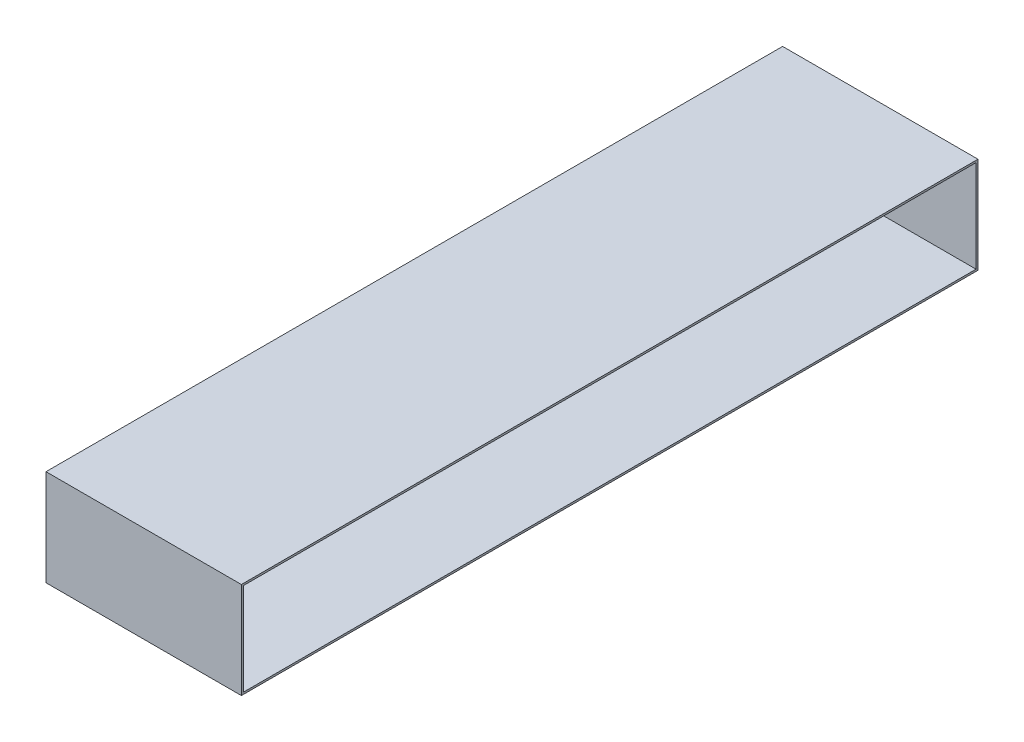
ISO-10303-21;
HEADER;
FILE_DESCRIPTION(('STEP AP214'),'2;1');
FILE_NAME('part.step','',(''),(''),'','','');
FILE_SCHEMA(('AUTOMOTIVE_DESIGN { 1 0 10303 214 1 1 1 1 }'));
ENDSEC;
DATA;
#1=APPLICATION_CONTEXT('core data for automotive mechanical design processes');
#2=APPLICATION_PROTOCOL_DEFINITION('international standard','automotive_design',2000,#1);
#3=PRODUCT_CONTEXT('',#1,'mechanical');
#4=PRODUCT('Part','Part','',(#3));
#5=PRODUCT_RELATED_PRODUCT_CATEGORY('part','',(#4));
#6=PRODUCT_DEFINITION_FORMATION('','',#4);
#7=PRODUCT_DEFINITION_CONTEXT('part definition',#1,'design');
#8=PRODUCT_DEFINITION('design','',#6,#7);
#9=PRODUCT_DEFINITION_SHAPE('','',#8);
#10=(LENGTH_UNIT() NAMED_UNIT(*) SI_UNIT(.MILLI.,.METRE.));
#11=(NAMED_UNIT(*) PLANE_ANGLE_UNIT() SI_UNIT($,.RADIAN.));
#12=(NAMED_UNIT(*) SI_UNIT($,.STERADIAN.) SOLID_ANGLE_UNIT());
#13=UNCERTAINTY_MEASURE_WITH_UNIT(LENGTH_MEASURE(1.E-05),#10,'distance_accuracy_value','');
#14=(GEOMETRIC_REPRESENTATION_CONTEXT(3) GLOBAL_UNCERTAINTY_ASSIGNED_CONTEXT((#13)) GLOBAL_UNIT_ASSIGNED_CONTEXT((#10,
#11,#12)) REPRESENTATION_CONTEXT('',''));
#15=CARTESIAN_POINT('',(0.,0.,0.));
#16=DIRECTION('',(0.,0.,1.));
#17=DIRECTION('',(1.,0.,0.));
#18=AXIS2_PLACEMENT_3D('',#15,#16,#17);
#19=CARTESIAN_POINT('',(12.7,6.254,47.879));
#20=DIRECTION('',(0.,-1.,0.));
#21=DIRECTION('',(0.,0.,-1.));
#22=AXIS2_PLACEMENT_3D('',#19,#20,#21);
#23=PLANE('',#22);
#24=DIRECTION('',(-1.,0.,0.));
#25=VECTOR('',#24,1.);
#26=CARTESIAN_POINT('',(12.7,6.254,47.879));
#27=LINE('',#26,#25);
#28=CARTESIAN_POINT('',(-12.7,6.254,47.879));
#29=VERTEX_POINT('',#28);
#30=CARTESIAN_POINT('',(12.7,6.254,47.879));
#31=VERTEX_POINT('',#30);
#32=EDGE_CURVE('E111',#29,#31,#27,.F.);
#33=ORIENTED_EDGE('',*,*,#32,.T.);
#34=DIRECTION('',(0.,0.,1.));
#35=VECTOR('',#34,1.);
#36=CARTESIAN_POINT('',(12.7,6.254,0.));
#37=LINE('',#36,#35);
#38=CARTESIAN_POINT('',(12.7,6.254,-47.879));
#39=VERTEX_POINT('',#38);
#40=EDGE_CURVE('E106',#31,#39,#37,.F.);
#41=ORIENTED_EDGE('',*,*,#40,.T.);
#42=DIRECTION('',(1.,0.,0.));
#43=VECTOR('',#42,1.);
#44=CARTESIAN_POINT('',(12.7,6.254,-47.879));
#45=LINE('',#44,#43);
#46=CARTESIAN_POINT('',(-12.7,6.254,-47.879));
#47=VERTEX_POINT('',#46);
#48=EDGE_CURVE('E128',#39,#47,#45,.F.);
#49=ORIENTED_EDGE('',*,*,#48,.T.);
#50=DIRECTION('',(0.,0.,1.));
#51=VECTOR('',#50,1.);
#52=CARTESIAN_POINT('',(-12.7,6.254,0.));
#53=LINE('',#52,#51);
#54=EDGE_CURVE('E134',#29,#47,#53,.F.);
#55=ORIENTED_EDGE('',*,*,#54,.F.);
#56=EDGE_LOOP('',(#33,#41,#49,#55));
#57=FACE_BOUND('',#56,.T.);
#58=ADVANCED_FACE('F16',(#57),#23,.F.);
#59=CARTESIAN_POINT('',(12.7,-6.,47.625));
#60=DIRECTION('',(0.,1.,0.));
#61=DIRECTION('',(0.,0.,1.));
#62=AXIS2_PLACEMENT_3D('',#59,#60,#61);
#63=PLANE('',#62);
#64=DIRECTION('',(0.,0.,1.));
#65=VECTOR('',#64,1.);
#66=CARTESIAN_POINT('',(12.7,-6.,0.));
#67=LINE('',#66,#65);
#68=CARTESIAN_POINT('',(12.7,-6.,47.625));
#69=VERTEX_POINT('',#68);
#70=CARTESIAN_POINT('',(12.7,-6.,-47.625));
#71=VERTEX_POINT('',#70);
#72=EDGE_CURVE('E99',#69,#71,#67,.F.);
#73=ORIENTED_EDGE('',*,*,#72,.T.);
#74=DIRECTION('',(1.,0.,0.));
#75=VECTOR('',#74,1.);
#76=CARTESIAN_POINT('',(12.7,-6.,-47.625));
#77=LINE('',#76,#75);
#78=CARTESIAN_POINT('',(-12.7,-6.,-47.625));
#79=VERTEX_POINT('',#78);
#80=EDGE_CURVE('E19',#79,#71,#77,.T.);
#81=ORIENTED_EDGE('',*,*,#80,.F.);
#82=DIRECTION('',(0.,0.,1.));
#83=VECTOR('',#82,1.);
#84=CARTESIAN_POINT('',(-12.7,-6.,0.));
#85=LINE('',#84,#83);
#86=CARTESIAN_POINT('',(-12.7,-6.,47.625));
#87=VERTEX_POINT('',#86);
#88=EDGE_CURVE('E137',#87,#79,#85,.F.);
#89=ORIENTED_EDGE('',*,*,#88,.F.);
#90=DIRECTION('',(-1.,0.,0.));
#91=VECTOR('',#90,1.);
#92=CARTESIAN_POINT('',(12.7,-6.,47.625));
#93=LINE('',#92,#91);
#94=EDGE_CURVE('E87',#69,#87,#93,.T.);
#95=ORIENTED_EDGE('',*,*,#94,.F.);
#96=EDGE_LOOP('',(#73,#81,#89,#95));
#97=FACE_BOUND('',#96,.T.);
#98=ADVANCED_FACE('F124',(#97),#63,.T.);
#99=CARTESIAN_POINT('',(12.7,-6.,-47.625));
#100=DIRECTION('',(0.,0.,1.));
#101=DIRECTION('',(1.,0.,0.));
#102=AXIS2_PLACEMENT_3D('',#99,#100,#101);
#103=PLANE('',#102);
#104=DIRECTION('',(0.,1.,0.));
#105=VECTOR('',#104,1.);
#106=CARTESIAN_POINT('',(12.7,0.,-47.625));
#107=LINE('',#106,#105);
#108=CARTESIAN_POINT('',(12.7,6.,-47.625));
#109=VERTEX_POINT('',#108);
#110=EDGE_CURVE('E118',#71,#109,#107,.T.);
#111=ORIENTED_EDGE('',*,*,#110,.T.);
#112=DIRECTION('',(1.,0.,0.));
#113=VECTOR('',#112,1.);
#114=CARTESIAN_POINT('',(12.7,6.,-47.625));
#115=LINE('',#114,#113);
#116=CARTESIAN_POINT('',(-12.7,6.,-47.625));
#117=VERTEX_POINT('',#116);
#118=EDGE_CURVE('E88',#117,#109,#115,.T.);
#119=ORIENTED_EDGE('',*,*,#118,.F.);
#120=DIRECTION('',(0.,1.,0.));
#121=VECTOR('',#120,1.);
#122=CARTESIAN_POINT('',(-12.7,0.,-47.625));
#123=LINE('',#122,#121);
#124=EDGE_CURVE('E119',#79,#117,#123,.T.);
#125=ORIENTED_EDGE('',*,*,#124,.F.);
#126=ORIENTED_EDGE('',*,*,#80,.T.);
#127=EDGE_LOOP('',(#111,#119,#125,#126));
#128=FACE_BOUND('',#127,.T.);
#129=ADVANCED_FACE('F117',(#128),#103,.T.);
#130=CARTESIAN_POINT('',(12.7,6.,47.625));
#131=DIRECTION('',(0.,-1.,0.));
#132=DIRECTION('',(0.,0.,-1.));
#133=AXIS2_PLACEMENT_3D('',#130,#131,#132);
#134=PLANE('',#133);
#135=DIRECTION('',(0.,0.,1.));
#136=VECTOR('',#135,1.);
#137=CARTESIAN_POINT('',(12.7,6.,0.));
#138=LINE('',#137,#136);
#139=CARTESIAN_POINT('',(12.7,6.,47.625));
#140=VERTEX_POINT('',#139);
#141=EDGE_CURVE('E96',#109,#140,#138,.T.);
#142=ORIENTED_EDGE('',*,*,#141,.T.);
#143=DIRECTION('',(-1.,0.,0.));
#144=VECTOR('',#143,1.);
#145=CARTESIAN_POINT('',(12.7,6.,47.625));
#146=LINE('',#145,#144);
#147=CARTESIAN_POINT('',(-12.7,6.,47.625));
#148=VERTEX_POINT('',#147);
#149=EDGE_CURVE('E78',#148,#140,#146,.F.);
#150=ORIENTED_EDGE('',*,*,#149,.F.);
#151=DIRECTION('',(0.,0.,1.));
#152=VECTOR('',#151,1.);
#153=CARTESIAN_POINT('',(-12.7,6.,0.));
#154=LINE('',#153,#152);
#155=EDGE_CURVE('E140',#117,#148,#154,.T.);
#156=ORIENTED_EDGE('',*,*,#155,.F.);
#157=ORIENTED_EDGE('',*,*,#118,.T.);
#158=EDGE_LOOP('',(#142,#150,#156,#157));
#159=FACE_BOUND('',#158,.T.);
#160=ADVANCED_FACE('F101',(#159),#134,.T.);
#161=CARTESIAN_POINT('',(12.7,-6.,47.625));
#162=DIRECTION('',(0.,0.,-1.));
#163=DIRECTION('',(-1.,0.,0.));
#164=AXIS2_PLACEMENT_3D('',#161,#162,#163);
#165=PLANE('',#164);
#166=DIRECTION('',(0.,1.,0.));
#167=VECTOR('',#166,1.);
#168=CARTESIAN_POINT('',(12.7,0.,47.625));
#169=LINE('',#168,#167);
#170=EDGE_CURVE('E81',#140,#69,#169,.F.);
#171=ORIENTED_EDGE('',*,*,#170,.T.);
#172=ORIENTED_EDGE('',*,*,#94,.T.);
#173=DIRECTION('',(0.,1.,0.));
#174=VECTOR('',#173,1.);
#175=CARTESIAN_POINT('',(-12.7,0.,47.625));
#176=LINE('',#175,#174);
#177=EDGE_CURVE('E83',#148,#87,#176,.F.);
#178=ORIENTED_EDGE('',*,*,#177,.F.);
#179=ORIENTED_EDGE('',*,*,#149,.T.);
#180=EDGE_LOOP('',(#171,#172,#178,#179));
#181=FACE_BOUND('',#180,.T.);
#182=ADVANCED_FACE('F80',(#181),#165,.T.);
#183=CARTESIAN_POINT('',(12.7,-6.254,47.879));
#184=DIRECTION('',(0.,0.,-1.));
#185=DIRECTION('',(-1.,0.,0.));
#186=AXIS2_PLACEMENT_3D('',#183,#184,#185);
#187=PLANE('',#186);
#188=DIRECTION('',(1.,0.,0.));
#189=VECTOR('',#188,1.);
#190=CARTESIAN_POINT('',(12.7,-6.254,47.879));
#191=LINE('',#190,#189);
#192=CARTESIAN_POINT('',(-12.7,-6.254,47.879));
#193=VERTEX_POINT('',#192);
#194=CARTESIAN_POINT('',(12.7,-6.254,47.879));
#195=VERTEX_POINT('',#194);
#196=EDGE_CURVE('E143',#193,#195,#191,.T.);
#197=ORIENTED_EDGE('',*,*,#196,.T.);
#198=DIRECTION('',(0.,1.,0.));
#199=VECTOR('',#198,1.);
#200=CARTESIAN_POINT('',(12.7,0.,47.879));
#201=LINE('',#200,#199);
#202=EDGE_CURVE('E103',#195,#31,#201,.T.);
#203=ORIENTED_EDGE('',*,*,#202,.T.);
#204=ORIENTED_EDGE('',*,*,#32,.F.);
#205=DIRECTION('',(0.,1.,0.));
#206=VECTOR('',#205,1.);
#207=CARTESIAN_POINT('',(-12.7,0.,47.879));
#208=LINE('',#207,#206);
#209=EDGE_CURVE('E131',#193,#29,#208,.T.);
#210=ORIENTED_EDGE('',*,*,#209,.F.);
#211=EDGE_LOOP('',(#197,#203,#204,#210));
#212=FACE_BOUND('',#211,.T.);
#213=ADVANCED_FACE('F159',(#212),#187,.F.);
#214=CARTESIAN_POINT('',(12.7,0.,0.));
#215=DIRECTION('',(-1.,0.,0.));
#216=DIRECTION('',(0.,0.,1.));
#217=AXIS2_PLACEMENT_3D('',#214,#215,#216);
#218=PLANE('',#217);
#219=ORIENTED_EDGE('',*,*,#72,.F.);
#220=ORIENTED_EDGE('',*,*,#170,.F.);
#221=ORIENTED_EDGE('',*,*,#141,.F.);
#222=ORIENTED_EDGE('',*,*,#110,.F.);
#223=EDGE_LOOP('',(#219,#220,#221,#222));
#224=FACE_BOUND('',#223,.T.);
#225=DIRECTION('',(0.,0.,1.));
#226=VECTOR('',#225,1.);
#227=CARTESIAN_POINT('',(12.7,-6.254,47.879));
#228=LINE('',#227,#226);
#229=CARTESIAN_POINT('',(12.7,-6.254,-47.879));
#230=VERTEX_POINT('',#229);
#231=EDGE_CURVE('E146',#195,#230,#228,.F.);
#232=ORIENTED_EDGE('',*,*,#231,.T.);
#233=DIRECTION('',(0.,-1.,0.));
#234=VECTOR('',#233,1.);
#235=CARTESIAN_POINT('',(12.7,-6.254,-47.879));
#236=LINE('',#235,#234);
#237=EDGE_CURVE('E122',#230,#39,#236,.F.);
#238=ORIENTED_EDGE('',*,*,#237,.T.);
#239=ORIENTED_EDGE('',*,*,#40,.F.);
#240=ORIENTED_EDGE('',*,*,#202,.F.);
#241=EDGE_LOOP('',(#232,#238,#239,#240));
#242=FACE_BOUND('',#241,.T.);
#243=ADVANCED_FACE('F93',(#224,#242),#218,.F.);
#244=CARTESIAN_POINT('',(12.7,-6.254,-47.879));
#245=DIRECTION('',(0.,0.,1.));
#246=DIRECTION('',(0.,-1.,0.));
#247=AXIS2_PLACEMENT_3D('',#244,#245,#246);
#248=PLANE('',#247);
#249=ORIENTED_EDGE('',*,*,#48,.F.);
#250=ORIENTED_EDGE('',*,*,#237,.F.);
#251=DIRECTION('',(1.,0.,0.));
#252=VECTOR('',#251,1.);
#253=CARTESIAN_POINT('',(12.7,-6.254,-47.879));
#254=LINE('',#253,#252);
#255=CARTESIAN_POINT('',(-12.7,-6.254,-47.879));
#256=VERTEX_POINT('',#255);
#257=EDGE_CURVE('E25',#230,#256,#254,.F.);
#258=ORIENTED_EDGE('',*,*,#257,.T.);
#259=DIRECTION('',(0.,1.,0.));
#260=VECTOR('',#259,1.);
#261=CARTESIAN_POINT('',(-12.7,0.,-47.879));
#262=LINE('',#261,#260);
#263=EDGE_CURVE('E33',#47,#256,#262,.F.);
#264=ORIENTED_EDGE('',*,*,#263,.F.);
#265=EDGE_LOOP('',(#249,#250,#258,#264));
#266=FACE_BOUND('',#265,.T.);
#267=ADVANCED_FACE('F153',(#266),#248,.F.);
#268=CARTESIAN_POINT('',(-12.7,0.,0.));
#269=DIRECTION('',(-1.,0.,0.));
#270=DIRECTION('',(0.,0.,1.));
#271=AXIS2_PLACEMENT_3D('',#268,#269,#270);
#272=PLANE('',#271);
#273=ORIENTED_EDGE('',*,*,#155,.T.);
#274=ORIENTED_EDGE('',*,*,#177,.T.);
#275=ORIENTED_EDGE('',*,*,#88,.T.);
#276=ORIENTED_EDGE('',*,*,#124,.T.);
#277=EDGE_LOOP('',(#273,#274,#275,#276));
#278=FACE_BOUND('',#277,.T.);
#279=ORIENTED_EDGE('',*,*,#263,.T.);
#280=DIRECTION('',(0.,0.,1.));
#281=VECTOR('',#280,1.);
#282=CARTESIAN_POINT('',(-12.7,-6.254,47.879));
#283=LINE('',#282,#281);
#284=EDGE_CURVE('E11',#256,#193,#283,.T.);
#285=ORIENTED_EDGE('',*,*,#284,.T.);
#286=ORIENTED_EDGE('',*,*,#209,.T.);
#287=ORIENTED_EDGE('',*,*,#54,.T.);
#288=EDGE_LOOP('',(#279,#285,#286,#287));
#289=FACE_BOUND('',#288,.T.);
#290=ADVANCED_FACE('F162',(#278,#289),#272,.T.);
#291=CARTESIAN_POINT('',(12.7,-6.254,47.879));
#292=DIRECTION('',(0.,1.,0.));
#293=DIRECTION('',(0.,0.,1.));
#294=AXIS2_PLACEMENT_3D('',#291,#292,#293);
#295=PLANE('',#294);
#296=ORIENTED_EDGE('',*,*,#257,.F.);
#297=ORIENTED_EDGE('',*,*,#231,.F.);
#298=ORIENTED_EDGE('',*,*,#196,.F.);
#299=ORIENTED_EDGE('',*,*,#284,.F.);
#300=EDGE_LOOP('',(#296,#297,#298,#299));
#301=FACE_BOUND('',#300,.T.);
#302=ADVANCED_FACE('F156',(#301),#295,.F.);
#303=CLOSED_SHELL('',(#58,#98,#129,#160,#182,#213,#243,#267,#290,#302));
#304=MANIFOLD_SOLID_BREP('B1',#303);
#305=ADVANCED_BREP_SHAPE_REPRESENTATION('',(#18,#304),#14);
#306=SHAPE_DEFINITION_REPRESENTATION(#9,#305);
ENDSEC;
END-ISO-10303-21;
